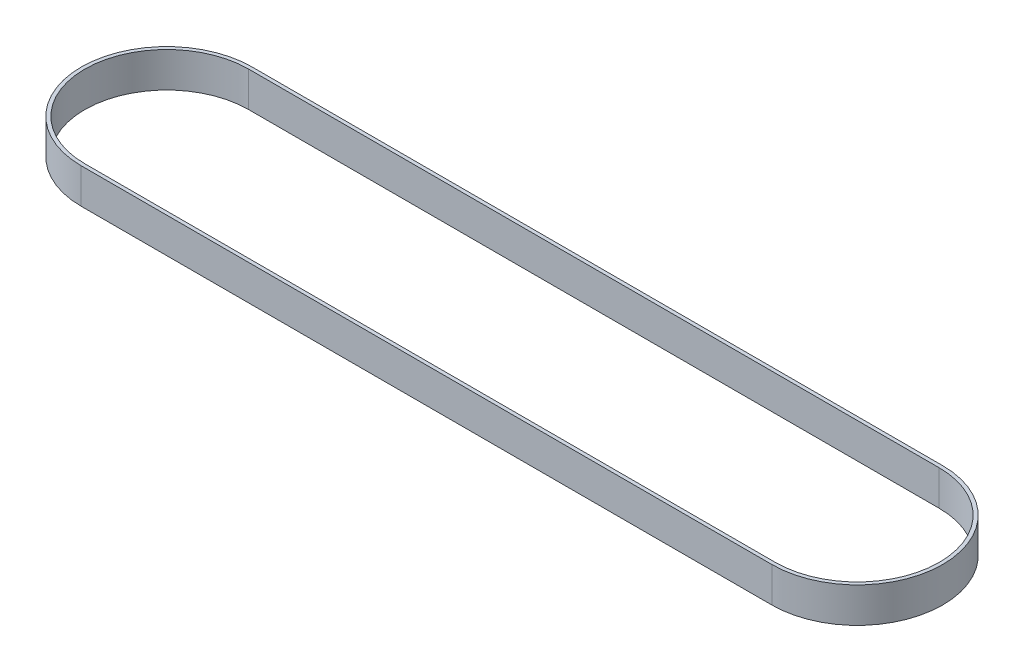
ISO-10303-21;
HEADER;
FILE_DESCRIPTION(('STEP AP214'),'2;1');
FILE_NAME('part.step','',(''),(''),'','','');
FILE_SCHEMA(('AUTOMOTIVE_DESIGN { 1 0 10303 214 1 1 1 1 }'));
ENDSEC;
DATA;
#1=APPLICATION_CONTEXT('core data for automotive mechanical design processes');
#2=APPLICATION_PROTOCOL_DEFINITION('international standard','automotive_design',2000,#1);
#3=PRODUCT_CONTEXT('',#1,'mechanical');
#4=PRODUCT('Part','Part','',(#3));
#5=PRODUCT_RELATED_PRODUCT_CATEGORY('part','',(#4));
#6=PRODUCT_DEFINITION_FORMATION('','',#4);
#7=PRODUCT_DEFINITION_CONTEXT('part definition',#1,'design');
#8=PRODUCT_DEFINITION('design','',#6,#7);
#9=PRODUCT_DEFINITION_SHAPE('','',#8);
#10=(LENGTH_UNIT() NAMED_UNIT(*) SI_UNIT(.MILLI.,.METRE.));
#11=(NAMED_UNIT(*) PLANE_ANGLE_UNIT() SI_UNIT($,.RADIAN.));
#12=(NAMED_UNIT(*) SI_UNIT($,.STERADIAN.) SOLID_ANGLE_UNIT());
#13=UNCERTAINTY_MEASURE_WITH_UNIT(LENGTH_MEASURE(1.E-05),#10,'distance_accuracy_value','');
#14=(GEOMETRIC_REPRESENTATION_CONTEXT(3) GLOBAL_UNCERTAINTY_ASSIGNED_CONTEXT((#13)) GLOBAL_UNIT_ASSIGNED_CONTEXT((#10,
#11,#12)) REPRESENTATION_CONTEXT('',''));
#15=CARTESIAN_POINT('',(0.,0.,0.));
#16=DIRECTION('',(0.,0.,1.));
#17=DIRECTION('',(1.,0.,0.));
#18=AXIS2_PLACEMENT_3D('',#15,#16,#17);
#19=CARTESIAN_POINT('',(0.,15.,0.));
#20=DIRECTION('',(0.,1.,0.));
#21=DIRECTION('',(0.,0.,1.));
#22=AXIS2_PLACEMENT_3D('',#19,#20,#21);
#23=PLANE('',#22);
#24=CARTESIAN_POINT('',(0.,15.,0.));
#25=DIRECTION('',(0.,1.,0.));
#26=DIRECTION('',(0.,0.,1.));
#27=AXIS2_PLACEMENT_3D('',#24,#25,#26);
#28=CIRCLE('',#27,36.5379);
#29=CARTESIAN_POINT('',(0.,15.,-36.5379));
#30=VERTEX_POINT('',#29);
#31=CARTESIAN_POINT('',(0.,15.,36.5379));
#32=VERTEX_POINT('',#31);
#33=EDGE_CURVE('E135',#30,#32,#28,.T.);
#34=ORIENTED_EDGE('',*,*,#33,.T.);
#35=DIRECTION('',(1.,0.,0.));
#36=VECTOR('',#35,1.);
#37=CARTESIAN_POINT('',(0.,15.,36.5379));
#38=LINE('',#37,#36);
#39=CARTESIAN_POINT('',(295.0718,15.,36.5379));
#40=VERTEX_POINT('',#39);
#41=EDGE_CURVE('E138',#32,#40,#38,.T.);
#42=ORIENTED_EDGE('',*,*,#41,.T.);
#43=CARTESIAN_POINT('',(295.0718,15.,0.));
#44=DIRECTION('',(0.,1.,0.));
#45=DIRECTION('',(0.,0.,1.));
#46=AXIS2_PLACEMENT_3D('',#43,#44,#45);
#47=CIRCLE('',#46,36.5379);
#48=CARTESIAN_POINT('',(295.0718,15.,-36.5379));
#49=VERTEX_POINT('',#48);
#50=EDGE_CURVE('E141',#40,#49,#47,.T.);
#51=ORIENTED_EDGE('',*,*,#50,.T.);
#52=DIRECTION('',(-1.,0.,0.));
#53=VECTOR('',#52,1.);
#54=CARTESIAN_POINT('',(0.,15.,-36.5379));
#55=LINE('',#54,#53);
#56=EDGE_CURVE('E143',#49,#30,#55,.T.);
#57=ORIENTED_EDGE('',*,*,#56,.T.);
#58=EDGE_LOOP('',(#34,#42,#51,#57));
#59=FACE_BOUND('',#58,.T.);
#60=DIRECTION('',(1.,0.,0.));
#61=VECTOR('',#60,1.);
#62=CARTESIAN_POINT('',(0.,15.,35.0139));
#63=LINE('',#62,#61);
#64=CARTESIAN_POINT('',(0.,15.,35.0139));
#65=VERTEX_POINT('',#64);
#66=CARTESIAN_POINT('',(295.0718,15.,35.0139));
#67=VERTEX_POINT('',#66);
#68=EDGE_CURVE('E107',#65,#67,#63,.T.);
#69=ORIENTED_EDGE('',*,*,#68,.F.);
#70=CARTESIAN_POINT('',(0.,15.,0.));
#71=DIRECTION('',(0.,1.,0.));
#72=DIRECTION('',(0.,0.,1.));
#73=AXIS2_PLACEMENT_3D('',#70,#71,#72);
#74=CIRCLE('',#73,35.0139);
#75=CARTESIAN_POINT('',(0.,15.,-35.0139));
#76=VERTEX_POINT('',#75);
#77=EDGE_CURVE('E99',#76,#65,#74,.T.);
#78=ORIENTED_EDGE('',*,*,#77,.F.);
#79=DIRECTION('',(-1.,0.,0.));
#80=VECTOR('',#79,1.);
#81=CARTESIAN_POINT('',(0.,15.,-35.0139));
#82=LINE('',#81,#80);
#83=CARTESIAN_POINT('',(295.0718,15.,-35.0139));
#84=VERTEX_POINT('',#83);
#85=EDGE_CURVE('E121',#84,#76,#82,.T.);
#86=ORIENTED_EDGE('',*,*,#85,.F.);
#87=CARTESIAN_POINT('',(295.0718,15.,0.));
#88=DIRECTION('',(0.,1.,0.));
#89=DIRECTION('',(0.,0.,1.));
#90=AXIS2_PLACEMENT_3D('',#87,#88,#89);
#91=CIRCLE('',#90,35.0139);
#92=EDGE_CURVE('E119',#67,#84,#91,.T.);
#93=ORIENTED_EDGE('',*,*,#92,.F.);
#94=EDGE_LOOP('',(#69,#78,#86,#93));
#95=FACE_BOUND('',#94,.T.);
#96=ADVANCED_FACE('F34',(#59,#95),#23,.T.);
#97=CARTESIAN_POINT('',(0.,0.,0.));
#98=DIRECTION('',(0.,1.,0.));
#99=DIRECTION('',(0.,0.,1.));
#100=AXIS2_PLACEMENT_3D('',#97,#98,#99);
#101=PLANE('',#100);
#102=CARTESIAN_POINT('',(0.,0.,0.));
#103=DIRECTION('',(0.,1.,0.));
#104=DIRECTION('',(0.,0.,1.));
#105=AXIS2_PLACEMENT_3D('',#102,#103,#104);
#106=CIRCLE('',#105,36.5379);
#107=CARTESIAN_POINT('',(0.,0.,-36.5379));
#108=VERTEX_POINT('',#107);
#109=CARTESIAN_POINT('',(0.,0.,36.5379));
#110=VERTEX_POINT('',#109);
#111=EDGE_CURVE('E115',#108,#110,#106,.T.);
#112=ORIENTED_EDGE('',*,*,#111,.F.);
#113=DIRECTION('',(-1.,0.,0.));
#114=VECTOR('',#113,1.);
#115=CARTESIAN_POINT('',(0.,0.,-36.5379));
#116=LINE('',#115,#114);
#117=CARTESIAN_POINT('',(295.0718,0.,-36.5379));
#118=VERTEX_POINT('',#117);
#119=EDGE_CURVE('E139',#118,#108,#116,.T.);
#120=ORIENTED_EDGE('',*,*,#119,.F.);
#121=CARTESIAN_POINT('',(295.0718,0.,0.));
#122=DIRECTION('',(0.,1.,0.));
#123=DIRECTION('',(0.,0.,1.));
#124=AXIS2_PLACEMENT_3D('',#121,#122,#123);
#125=CIRCLE('',#124,36.5379);
#126=CARTESIAN_POINT('',(295.0718,0.,36.5379));
#127=VERTEX_POINT('',#126);
#128=EDGE_CURVE('E150',#127,#118,#125,.T.);
#129=ORIENTED_EDGE('',*,*,#128,.F.);
#130=DIRECTION('',(1.,0.,0.));
#131=VECTOR('',#130,1.);
#132=CARTESIAN_POINT('',(0.,0.,36.5379));
#133=LINE('',#132,#131);
#134=EDGE_CURVE('E148',#110,#127,#133,.T.);
#135=ORIENTED_EDGE('',*,*,#134,.F.);
#136=EDGE_LOOP('',(#112,#120,#129,#135));
#137=FACE_BOUND('',#136,.T.);
#138=CARTESIAN_POINT('',(0.,0.,0.));
#139=DIRECTION('',(0.,1.,0.));
#140=DIRECTION('',(0.,0.,1.));
#141=AXIS2_PLACEMENT_3D('',#138,#139,#140);
#142=CIRCLE('',#141,35.0139);
#143=CARTESIAN_POINT('',(0.,0.,-35.0139));
#144=VERTEX_POINT('',#143);
#145=CARTESIAN_POINT('',(0.,0.,35.0139));
#146=VERTEX_POINT('',#145);
#147=EDGE_CURVE('E57',#144,#146,#142,.T.);
#148=ORIENTED_EDGE('',*,*,#147,.T.);
#149=DIRECTION('',(1.,0.,0.));
#150=VECTOR('',#149,1.);
#151=CARTESIAN_POINT('',(0.,0.,35.0139));
#152=LINE('',#151,#150);
#153=CARTESIAN_POINT('',(295.0718,0.,35.0139));
#154=VERTEX_POINT('',#153);
#155=EDGE_CURVE('E114',#146,#154,#152,.T.);
#156=ORIENTED_EDGE('',*,*,#155,.T.);
#157=CARTESIAN_POINT('',(295.0718,0.,0.));
#158=DIRECTION('',(0.,1.,0.));
#159=DIRECTION('',(0.,0.,1.));
#160=AXIS2_PLACEMENT_3D('',#157,#158,#159);
#161=CIRCLE('',#160,35.0139);
#162=CARTESIAN_POINT('',(295.0718,0.,-35.0139));
#163=VERTEX_POINT('',#162);
#164=EDGE_CURVE('E127',#154,#163,#161,.T.);
#165=ORIENTED_EDGE('',*,*,#164,.T.);
#166=DIRECTION('',(-1.,0.,0.));
#167=VECTOR('',#166,1.);
#168=CARTESIAN_POINT('',(0.,0.,-35.0139));
#169=LINE('',#168,#167);
#170=EDGE_CURVE('E108',#163,#144,#169,.T.);
#171=ORIENTED_EDGE('',*,*,#170,.T.);
#172=EDGE_LOOP('',(#148,#156,#165,#171));
#173=FACE_BOUND('',#172,.T.);
#174=ADVANCED_FACE('F168',(#137,#173),#101,.F.);
#175=CARTESIAN_POINT('',(0.,15.,0.));
#176=DIRECTION('',(0.,-1.,0.));
#177=DIRECTION('',(0.,0.,-1.));
#178=AXIS2_PLACEMENT_3D('',#175,#176,#177);
#179=CYLINDRICAL_SURFACE('',#178,36.5379);
#180=ORIENTED_EDGE('',*,*,#111,.T.);
#181=DIRECTION('',(0.,-1.,0.));
#182=VECTOR('',#181,1.);
#183=CARTESIAN_POINT('',(0.,15.,36.5379));
#184=LINE('',#183,#182);
#185=EDGE_CURVE('E11',#32,#110,#184,.T.);
#186=ORIENTED_EDGE('',*,*,#185,.F.);
#187=ORIENTED_EDGE('',*,*,#33,.F.);
#188=DIRECTION('',(0.,-1.,0.));
#189=VECTOR('',#188,1.);
#190=CARTESIAN_POINT('',(0.,15.,-36.5379));
#191=LINE('',#190,#189);
#192=EDGE_CURVE('E145',#30,#108,#191,.T.);
#193=ORIENTED_EDGE('',*,*,#192,.T.);
#194=EDGE_LOOP('',(#180,#186,#187,#193));
#195=FACE_BOUND('',#194,.T.);
#196=ADVANCED_FACE('F36',(#195),#179,.T.);
#197=CARTESIAN_POINT('',(0.,15.,36.5379));
#198=DIRECTION('',(0.,0.,-1.));
#199=DIRECTION('',(-1.,0.,0.));
#200=AXIS2_PLACEMENT_3D('',#197,#198,#199);
#201=PLANE('',#200);
#202=ORIENTED_EDGE('',*,*,#134,.T.);
#203=DIRECTION('',(0.,-1.,0.));
#204=VECTOR('',#203,1.);
#205=CARTESIAN_POINT('',(295.0718,15.,36.5379));
#206=LINE('',#205,#204);
#207=EDGE_CURVE('E42',#40,#127,#206,.T.);
#208=ORIENTED_EDGE('',*,*,#207,.F.);
#209=ORIENTED_EDGE('',*,*,#41,.F.);
#210=ORIENTED_EDGE('',*,*,#185,.T.);
#211=EDGE_LOOP('',(#202,#208,#209,#210));
#212=FACE_BOUND('',#211,.T.);
#213=ADVANCED_FACE('F178',(#212),#201,.F.);
#214=CARTESIAN_POINT('',(295.0718,15.,0.));
#215=DIRECTION('',(0.,-1.,0.));
#216=DIRECTION('',(0.,0.,-1.));
#217=AXIS2_PLACEMENT_3D('',#214,#215,#216);
#218=CYLINDRICAL_SURFACE('',#217,36.5379);
#219=ORIENTED_EDGE('',*,*,#128,.T.);
#220=DIRECTION('',(0.,-1.,0.));
#221=VECTOR('',#220,1.);
#222=CARTESIAN_POINT('',(295.0718,15.,-36.5379));
#223=LINE('',#222,#221);
#224=EDGE_CURVE('E155',#49,#118,#223,.T.);
#225=ORIENTED_EDGE('',*,*,#224,.F.);
#226=ORIENTED_EDGE('',*,*,#50,.F.);
#227=ORIENTED_EDGE('',*,*,#207,.T.);
#228=EDGE_LOOP('',(#219,#225,#226,#227));
#229=FACE_BOUND('',#228,.T.);
#230=ADVANCED_FACE('F162',(#229),#218,.T.);
#231=CARTESIAN_POINT('',(0.,15.,-36.5379));
#232=DIRECTION('',(0.,0.,1.));
#233=DIRECTION('',(1.,0.,0.));
#234=AXIS2_PLACEMENT_3D('',#231,#232,#233);
#235=PLANE('',#234);
#236=ORIENTED_EDGE('',*,*,#119,.T.);
#237=ORIENTED_EDGE('',*,*,#192,.F.);
#238=ORIENTED_EDGE('',*,*,#56,.F.);
#239=ORIENTED_EDGE('',*,*,#224,.T.);
#240=EDGE_LOOP('',(#236,#237,#238,#239));
#241=FACE_BOUND('',#240,.T.);
#242=ADVANCED_FACE('F172',(#241),#235,.F.);
#243=CARTESIAN_POINT('',(0.,15.,0.));
#244=DIRECTION('',(0.,-1.,0.));
#245=DIRECTION('',(0.,0.,-1.));
#246=AXIS2_PLACEMENT_3D('',#243,#244,#245);
#247=CYLINDRICAL_SURFACE('',#246,35.0139);
#248=ORIENTED_EDGE('',*,*,#147,.F.);
#249=DIRECTION('',(0.,-1.,0.));
#250=VECTOR('',#249,1.);
#251=CARTESIAN_POINT('',(0.,15.,-35.0139));
#252=LINE('',#251,#250);
#253=EDGE_CURVE('E103',#76,#144,#252,.T.);
#254=ORIENTED_EDGE('',*,*,#253,.F.);
#255=ORIENTED_EDGE('',*,*,#77,.T.);
#256=DIRECTION('',(0.,-1.,0.));
#257=VECTOR('',#256,1.);
#258=CARTESIAN_POINT('',(0.,15.,35.0139));
#259=LINE('',#258,#257);
#260=EDGE_CURVE('E102',#65,#146,#259,.T.);
#261=ORIENTED_EDGE('',*,*,#260,.T.);
#262=EDGE_LOOP('',(#248,#254,#255,#261));
#263=FACE_BOUND('',#262,.T.);
#264=ADVANCED_FACE('F101',(#263),#247,.F.);
#265=CARTESIAN_POINT('',(0.,15.,35.0139));
#266=DIRECTION('',(0.,0.,-1.));
#267=DIRECTION('',(-1.,0.,0.));
#268=AXIS2_PLACEMENT_3D('',#265,#266,#267);
#269=PLANE('',#268);
#270=ORIENTED_EDGE('',*,*,#155,.F.);
#271=ORIENTED_EDGE('',*,*,#260,.F.);
#272=ORIENTED_EDGE('',*,*,#68,.T.);
#273=DIRECTION('',(0.,-1.,0.));
#274=VECTOR('',#273,1.);
#275=CARTESIAN_POINT('',(295.0718,15.,35.0139));
#276=LINE('',#275,#274);
#277=EDGE_CURVE('E116',#67,#154,#276,.T.);
#278=ORIENTED_EDGE('',*,*,#277,.T.);
#279=EDGE_LOOP('',(#270,#271,#272,#278));
#280=FACE_BOUND('',#279,.T.);
#281=ADVANCED_FACE('F111',(#280),#269,.T.);
#282=CARTESIAN_POINT('',(295.0718,15.,0.));
#283=DIRECTION('',(0.,-1.,0.));
#284=DIRECTION('',(0.,0.,-1.));
#285=AXIS2_PLACEMENT_3D('',#282,#283,#284);
#286=CYLINDRICAL_SURFACE('',#285,35.0139);
#287=ORIENTED_EDGE('',*,*,#164,.F.);
#288=ORIENTED_EDGE('',*,*,#277,.F.);
#289=ORIENTED_EDGE('',*,*,#92,.T.);
#290=DIRECTION('',(0.,-1.,0.));
#291=VECTOR('',#290,1.);
#292=CARTESIAN_POINT('',(295.0718,15.,-35.0139));
#293=LINE('',#292,#291);
#294=EDGE_CURVE('E49',#84,#163,#293,.T.);
#295=ORIENTED_EDGE('',*,*,#294,.T.);
#296=EDGE_LOOP('',(#287,#288,#289,#295));
#297=FACE_BOUND('',#296,.T.);
#298=ADVANCED_FACE('F201',(#297),#286,.F.);
#299=CARTESIAN_POINT('',(0.,15.,-35.0139));
#300=DIRECTION('',(0.,0.,1.));
#301=DIRECTION('',(1.,0.,0.));
#302=AXIS2_PLACEMENT_3D('',#299,#300,#301);
#303=PLANE('',#302);
#304=ORIENTED_EDGE('',*,*,#170,.F.);
#305=ORIENTED_EDGE('',*,*,#294,.F.);
#306=ORIENTED_EDGE('',*,*,#85,.T.);
#307=ORIENTED_EDGE('',*,*,#253,.T.);
#308=EDGE_LOOP('',(#304,#305,#306,#307));
#309=FACE_BOUND('',#308,.T.);
#310=ADVANCED_FACE('F205',(#309),#303,.T.);
#311=CLOSED_SHELL('',(#96,#174,#196,#213,#230,#242,#264,#281,#298,#310));
#312=MANIFOLD_SOLID_BREP('B2',#311);
#313=ADVANCED_BREP_SHAPE_REPRESENTATION('',(#18,#312),#14);
#314=SHAPE_DEFINITION_REPRESENTATION(#9,#313);
ENDSEC;
END-ISO-10303-21;
